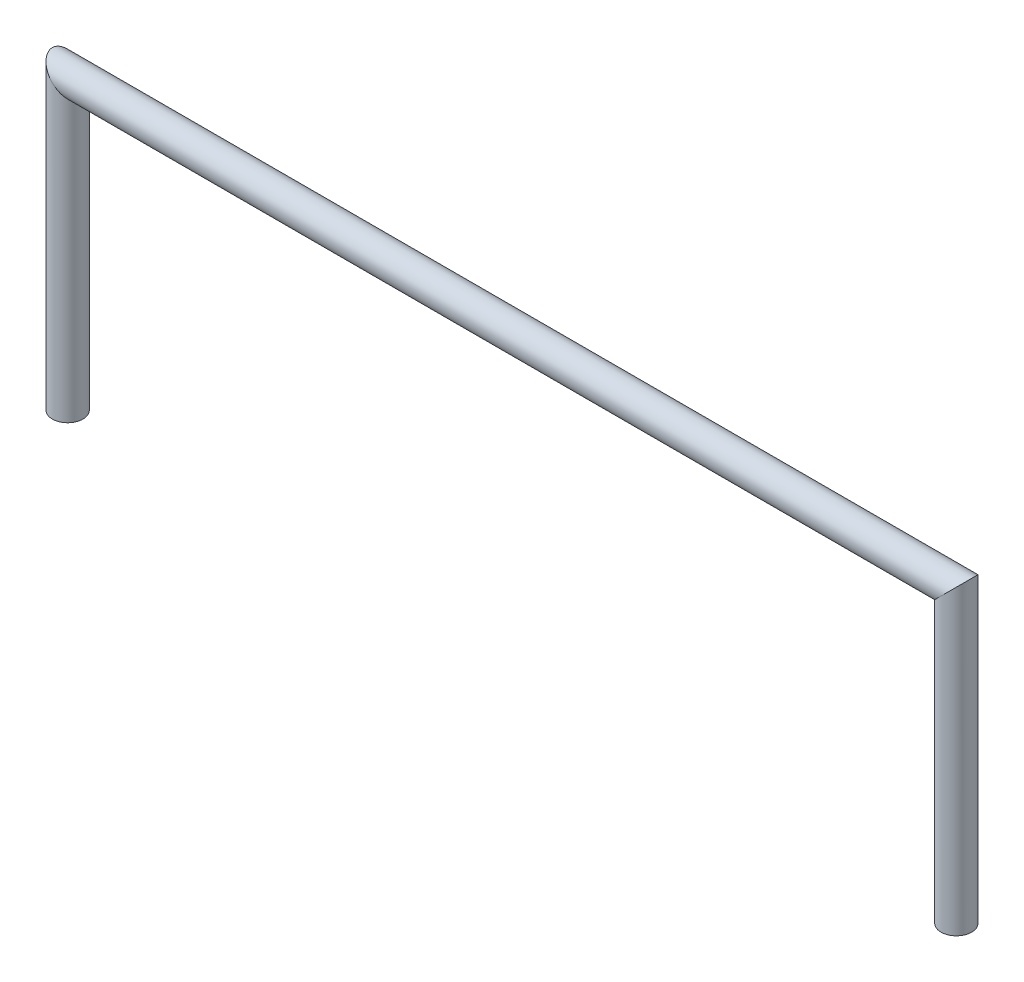
ISO-10303-21;
HEADER;
FILE_DESCRIPTION(('STEP AP214'),'2;1');
FILE_NAME('part.step','',(''),(''),'','','');
FILE_SCHEMA(('AUTOMOTIVE_DESIGN { 1 0 10303 214 1 1 1 1 }'));
ENDSEC;
DATA;
#1=APPLICATION_CONTEXT('core data for automotive mechanical design processes');
#2=APPLICATION_PROTOCOL_DEFINITION('international standard','automotive_design',2000,#1);
#3=PRODUCT_CONTEXT('',#1,'mechanical');
#4=PRODUCT('Part','Part','',(#3));
#5=PRODUCT_RELATED_PRODUCT_CATEGORY('part','',(#4));
#6=PRODUCT_DEFINITION_FORMATION('','',#4);
#7=PRODUCT_DEFINITION_CONTEXT('part definition',#1,'design');
#8=PRODUCT_DEFINITION('design','',#6,#7);
#9=PRODUCT_DEFINITION_SHAPE('','',#8);
#10=(LENGTH_UNIT() NAMED_UNIT(*) SI_UNIT(.MILLI.,.METRE.));
#11=(NAMED_UNIT(*) PLANE_ANGLE_UNIT() SI_UNIT($,.RADIAN.));
#12=(NAMED_UNIT(*) SI_UNIT($,.STERADIAN.) SOLID_ANGLE_UNIT());
#13=UNCERTAINTY_MEASURE_WITH_UNIT(LENGTH_MEASURE(1.E-05),#10,'distance_accuracy_value','');
#14=(GEOMETRIC_REPRESENTATION_CONTEXT(3) GLOBAL_UNCERTAINTY_ASSIGNED_CONTEXT((#13)) GLOBAL_UNIT_ASSIGNED_CONTEXT((#10,
#11,#12)) REPRESENTATION_CONTEXT('',''));
#15=CARTESIAN_POINT('',(0.,0.,0.));
#16=DIRECTION('',(0.,0.,1.));
#17=DIRECTION('',(1.,0.,0.));
#18=AXIS2_PLACEMENT_3D('',#15,#16,#17);
#19=CARTESIAN_POINT('',(736.6,269.34,0.));
#20=DIRECTION('',(0.,-1.,0.));
#21=DIRECTION('',(1.,0.,0.));
#22=AXIS2_PLACEMENT_3D('',#19,#20,#21);
#23=CYLINDRICAL_SURFACE('',#22,12.7);
#24=CARTESIAN_POINT('',(736.6,241.3,0.));
#25=DIRECTION('',(0.707106781186547,-0.707106781186548,0.));
#26=DIRECTION('',(0.707106781186548,0.707106781186547,0.));
#27=AXIS2_PLACEMENT_3D('',#24,#25,#26);
#28=ELLIPSE('',#27,17.9605122421383,12.7);
#29=CARTESIAN_POINT('',(749.3,254.,0.));
#30=VERTEX_POINT('',#29);
#31=EDGE_CURVE('E49',#30,#30,#28,.F.);
#32=ORIENTED_EDGE('',*,*,#31,.F.);
#33=EDGE_LOOP('',(#32));
#34=FACE_BOUND('',#33,.T.);
#35=CARTESIAN_POINT('',(736.6,1.38777878078144E-13,0.));
#36=DIRECTION('',(0.,-1.,0.));
#37=DIRECTION('',(0.,0.,1.));
#38=AXIS2_PLACEMENT_3D('',#35,#36,#37);
#39=CIRCLE('',#38,12.7);
#40=CARTESIAN_POINT('',(736.6,1.38777878078144E-13,12.7));
#41=VERTEX_POINT('',#40);
#42=EDGE_CURVE('E60',#41,#41,#39,.T.);
#43=ORIENTED_EDGE('',*,*,#42,.F.);
#44=EDGE_LOOP('',(#43));
#45=FACE_BOUND('',#44,.T.);
#46=ADVANCED_FACE('F46',(#34,#45),#23,.T.);
#47=CARTESIAN_POINT('',(-28.04,241.3,0.));
#48=DIRECTION('',(1.,0.,0.));
#49=DIRECTION('',(0.,0.,-1.));
#50=AXIS2_PLACEMENT_3D('',#47,#48,#49);
#51=CYLINDRICAL_SURFACE('',#50,12.7);
#52=CARTESIAN_POINT('',(0.,241.3,0.));
#53=DIRECTION('',(0.707106781186548,0.707106781186548,0.));
#54=DIRECTION('',(-0.707106781186548,0.707106781186548,0.));
#55=AXIS2_PLACEMENT_3D('',#52,#53,#54);
#56=ELLIPSE('',#55,17.9605122421383,12.7);
#57=CARTESIAN_POINT('',(-12.7,254.,0.));
#58=VERTEX_POINT('',#57);
#59=EDGE_CURVE('E99',#58,#58,#56,.F.);
#60=ORIENTED_EDGE('',*,*,#59,.F.);
#61=EDGE_LOOP('',(#60));
#62=FACE_BOUND('',#61,.T.);
#63=ORIENTED_EDGE('',*,*,#31,.T.);
#64=EDGE_LOOP('',(#63));
#65=FACE_BOUND('',#64,.T.);
#66=ADVANCED_FACE('F103',(#62,#65),#51,.T.);
#67=CARTESIAN_POINT('',(0.,0.,0.));
#68=DIRECTION('',(0.,1.,0.));
#69=DIRECTION('',(0.,0.,1.));
#70=AXIS2_PLACEMENT_3D('',#67,#68,#69);
#71=CYLINDRICAL_SURFACE('',#70,12.7);
#72=CARTESIAN_POINT('',(0.,0.,0.));
#73=DIRECTION('',(0.,1.,0.));
#74=DIRECTION('',(0.,0.,1.));
#75=AXIS2_PLACEMENT_3D('',#72,#73,#74);
#76=CIRCLE('',#75,12.7);
#77=CARTESIAN_POINT('',(0.,0.,12.7));
#78=VERTEX_POINT('',#77);
#79=EDGE_CURVE('E66',#78,#78,#76,.T.);
#80=ORIENTED_EDGE('',*,*,#79,.T.);
#81=EDGE_LOOP('',(#80));
#82=FACE_BOUND('',#81,.T.);
#83=ORIENTED_EDGE('',*,*,#59,.T.);
#84=EDGE_LOOP('',(#83));
#85=FACE_BOUND('',#84,.T.);
#86=ADVANCED_FACE('F105',(#82,#85),#71,.T.);
#87=CARTESIAN_POINT('',(736.6,1.38777878078144E-13,0.));
#88=DIRECTION('',(0.,-1.,0.));
#89=DIRECTION('',(0.,0.,1.));
#90=AXIS2_PLACEMENT_3D('',#87,#88,#89);
#91=PLANE('',#90);
#92=CARTESIAN_POINT('',(736.6,1.38777878078144E-13,0.));
#93=DIRECTION('',(0.,-1.,0.));
#94=DIRECTION('',(0.,0.,1.));
#95=AXIS2_PLACEMENT_3D('',#92,#93,#94);
#96=CIRCLE('',#95,8.73125);
#97=CARTESIAN_POINT('',(736.6,1.38777878078144E-13,8.73125));
#98=VERTEX_POINT('',#97);
#99=EDGE_CURVE('E92',#98,#98,#96,.F.);
#100=ORIENTED_EDGE('',*,*,#99,.T.);
#101=EDGE_LOOP('',(#100));
#102=FACE_BOUND('',#101,.T.);
#103=ORIENTED_EDGE('',*,*,#42,.T.);
#104=EDGE_LOOP('',(#103));
#105=FACE_BOUND('',#104,.T.);
#106=ADVANCED_FACE('F111',(#102,#105),#91,.T.);
#107=CARTESIAN_POINT('',(0.,0.,0.));
#108=DIRECTION('',(0.,1.,0.));
#109=DIRECTION('',(0.,0.,1.));
#110=AXIS2_PLACEMENT_3D('',#107,#108,#109);
#111=PLANE('',#110);
#112=CARTESIAN_POINT('',(0.,0.,0.));
#113=DIRECTION('',(0.,1.,0.));
#114=DIRECTION('',(0.,0.,1.));
#115=AXIS2_PLACEMENT_3D('',#112,#113,#114);
#116=CIRCLE('',#115,8.73125);
#117=CARTESIAN_POINT('',(0.,0.,8.73125));
#118=VERTEX_POINT('',#117);
#119=EDGE_CURVE('E54',#118,#118,#116,.F.);
#120=ORIENTED_EDGE('',*,*,#119,.F.);
#121=EDGE_LOOP('',(#120));
#122=FACE_BOUND('',#121,.T.);
#123=ORIENTED_EDGE('',*,*,#79,.F.);
#124=EDGE_LOOP('',(#123));
#125=FACE_BOUND('',#124,.T.);
#126=ADVANCED_FACE('F126',(#122,#125),#111,.F.);
#127=CARTESIAN_POINT('',(736.6,260.60875,0.));
#128=DIRECTION('',(0.,-1.,0.));
#129=DIRECTION('',(1.,0.,0.));
#130=AXIS2_PLACEMENT_3D('',#127,#128,#129);
#131=CYLINDRICAL_SURFACE('',#130,8.73125);
#132=CARTESIAN_POINT('',(736.6,241.3,0.));
#133=DIRECTION('',(0.707106781186547,-0.707106781186548,0.));
#134=DIRECTION('',(0.707106781186548,0.707106781186547,0.));
#135=AXIS2_PLACEMENT_3D('',#132,#133,#134);
#136=ELLIPSE('',#135,12.3478521664701,8.73125);
#137=CARTESIAN_POINT('',(745.33125,250.03125,0.));
#138=VERTEX_POINT('',#137);
#139=EDGE_CURVE('E88',#138,#138,#136,.T.);
#140=ORIENTED_EDGE('',*,*,#139,.F.);
#141=EDGE_LOOP('',(#140));
#142=FACE_BOUND('',#141,.T.);
#143=ORIENTED_EDGE('',*,*,#99,.F.);
#144=EDGE_LOOP('',(#143));
#145=FACE_BOUND('',#144,.T.);
#146=ADVANCED_FACE('F89',(#142,#145),#131,.F.);
#147=CARTESIAN_POINT('',(-19.30875,241.3,0.));
#148=DIRECTION('',(1.,0.,0.));
#149=DIRECTION('',(0.,0.,-1.));
#150=AXIS2_PLACEMENT_3D('',#147,#148,#149);
#151=CYLINDRICAL_SURFACE('',#150,8.73125);
#152=CARTESIAN_POINT('',(0.,241.3,0.));
#153=DIRECTION('',(0.707106781186548,0.707106781186548,0.));
#154=DIRECTION('',(-0.707106781186548,0.707106781186548,0.));
#155=AXIS2_PLACEMENT_3D('',#152,#153,#154);
#156=ELLIPSE('',#155,12.3478521664701,8.73125);
#157=CARTESIAN_POINT('',(-8.73125,250.03125,0.));
#158=VERTEX_POINT('',#157);
#159=EDGE_CURVE('E13',#158,#158,#156,.T.);
#160=ORIENTED_EDGE('',*,*,#159,.F.);
#161=EDGE_LOOP('',(#160));
#162=FACE_BOUND('',#161,.T.);
#163=ORIENTED_EDGE('',*,*,#139,.T.);
#164=EDGE_LOOP('',(#163));
#165=FACE_BOUND('',#164,.T.);
#166=ADVANCED_FACE('F115',(#162,#165),#151,.F.);
#167=CARTESIAN_POINT('',(0.,0.,0.));
#168=DIRECTION('',(0.,1.,0.));
#169=DIRECTION('',(0.,0.,1.));
#170=AXIS2_PLACEMENT_3D('',#167,#168,#169);
#171=CYLINDRICAL_SURFACE('',#170,8.73125);
#172=ORIENTED_EDGE('',*,*,#119,.T.);
#173=EDGE_LOOP('',(#172));
#174=FACE_BOUND('',#173,.T.);
#175=ORIENTED_EDGE('',*,*,#159,.T.);
#176=EDGE_LOOP('',(#175));
#177=FACE_BOUND('',#176,.T.);
#178=ADVANCED_FACE('F113',(#174,#177),#171,.F.);
#179=CLOSED_SHELL('',(#46,#66,#86,#106,#126,#146,#166,#178));
#180=MANIFOLD_SOLID_BREP('B2',#179);
#181=ADVANCED_BREP_SHAPE_REPRESENTATION('',(#18,#180),#14);
#182=SHAPE_DEFINITION_REPRESENTATION(#9,#181);
ENDSEC;
END-ISO-10303-21;
